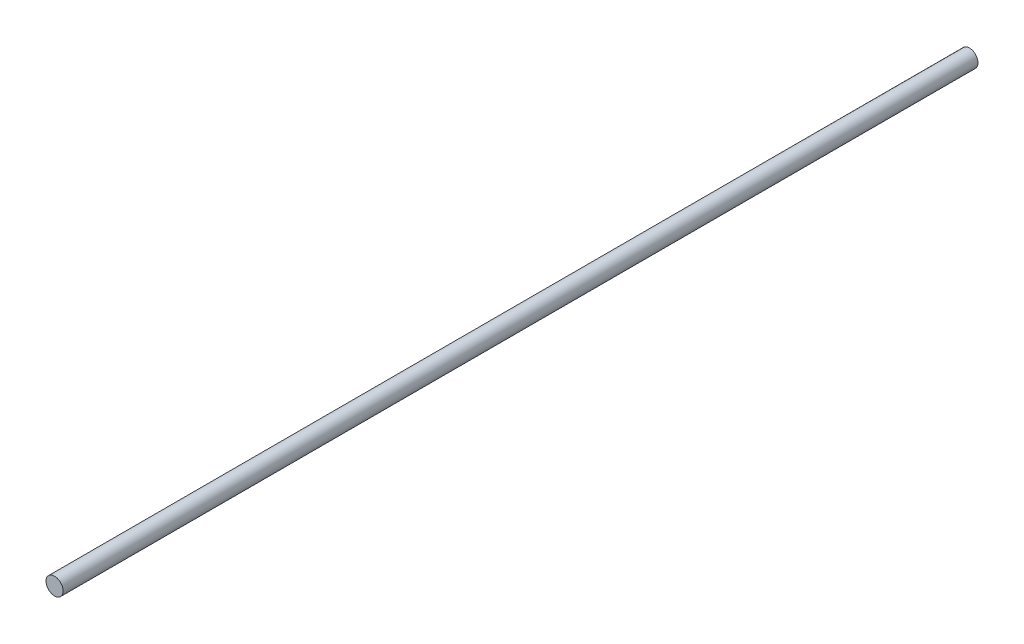
ISO-10303-21;
HEADER;
FILE_DESCRIPTION(('STEP AP214'),'2;1');
FILE_NAME('part.step','',(''),(''),'','','');
FILE_SCHEMA(('AUTOMOTIVE_DESIGN { 1 0 10303 214 1 1 1 1 }'));
ENDSEC;
DATA;
#1=APPLICATION_CONTEXT('core data for automotive mechanical design processes');
#2=APPLICATION_PROTOCOL_DEFINITION('international standard','automotive_design',2000,#1);
#3=PRODUCT_CONTEXT('',#1,'mechanical');
#4=PRODUCT('Part','Part','',(#3));
#5=PRODUCT_RELATED_PRODUCT_CATEGORY('part','',(#4));
#6=PRODUCT_DEFINITION_FORMATION('','',#4);
#7=PRODUCT_DEFINITION_CONTEXT('part definition',#1,'design');
#8=PRODUCT_DEFINITION('design','',#6,#7);
#9=PRODUCT_DEFINITION_SHAPE('','',#8);
#10=(LENGTH_UNIT() NAMED_UNIT(*) SI_UNIT(.MILLI.,.METRE.));
#11=(NAMED_UNIT(*) PLANE_ANGLE_UNIT() SI_UNIT($,.RADIAN.));
#12=(NAMED_UNIT(*) SI_UNIT($,.STERADIAN.) SOLID_ANGLE_UNIT());
#13=UNCERTAINTY_MEASURE_WITH_UNIT(LENGTH_MEASURE(1.E-05),#10,'distance_accuracy_value','');
#14=(GEOMETRIC_REPRESENTATION_CONTEXT(3) GLOBAL_UNCERTAINTY_ASSIGNED_CONTEXT((#13)) GLOBAL_UNIT_ASSIGNED_CONTEXT((#10,
#11,#12)) REPRESENTATION_CONTEXT('',''));
#15=CARTESIAN_POINT('',(0.,0.,0.));
#16=DIRECTION('',(0.,0.,1.));
#17=DIRECTION('',(1.,0.,0.));
#18=AXIS2_PLACEMENT_3D('',#15,#16,#17);
#19=CARTESIAN_POINT('',(0.,0.,160.));
#20=DIRECTION('',(0.,0.,-1.));
#21=DIRECTION('',(-1.,0.,0.));
#22=AXIS2_PLACEMENT_3D('',#19,#20,#21);
#23=CYLINDRICAL_SURFACE('',#22,1.5);
#24=CARTESIAN_POINT('',(0.,0.,160.));
#25=DIRECTION('',(0.,0.,1.));
#26=DIRECTION('',(1.,0.,0.));
#27=AXIS2_PLACEMENT_3D('',#24,#25,#26);
#28=CIRCLE('',#27,1.5);
#29=CARTESIAN_POINT('',(1.5,0.,160.));
#30=VERTEX_POINT('',#29);
#31=EDGE_CURVE('E10',#30,#30,#28,.T.);
#32=ORIENTED_EDGE('',*,*,#31,.F.);
#33=EDGE_LOOP('',(#32));
#34=FACE_BOUND('',#33,.T.);
#35=CARTESIAN_POINT('',(0.,0.,0.));
#36=DIRECTION('',(0.,0.,1.));
#37=DIRECTION('',(1.,0.,0.));
#38=AXIS2_PLACEMENT_3D('',#35,#36,#37);
#39=CIRCLE('',#38,1.5);
#40=CARTESIAN_POINT('',(1.5,0.,0.));
#41=VERTEX_POINT('',#40);
#42=EDGE_CURVE('E34',#41,#41,#39,.T.);
#43=ORIENTED_EDGE('',*,*,#42,.T.);
#44=EDGE_LOOP('',(#43));
#45=FACE_BOUND('',#44,.T.);
#46=ADVANCED_FACE('F31',(#34,#45),#23,.T.);
#47=CARTESIAN_POINT('',(0.,0.,160.));
#48=DIRECTION('',(0.,0.,1.));
#49=DIRECTION('',(1.,0.,0.));
#50=AXIS2_PLACEMENT_3D('',#47,#48,#49);
#51=PLANE('',#50);
#52=ORIENTED_EDGE('',*,*,#31,.T.);
#53=EDGE_LOOP('',(#52));
#54=FACE_BOUND('',#53,.T.);
#55=ADVANCED_FACE('F46',(#54),#51,.T.);
#56=CARTESIAN_POINT('',(0.,0.,0.));
#57=DIRECTION('',(0.,0.,1.));
#58=DIRECTION('',(1.,0.,0.));
#59=AXIS2_PLACEMENT_3D('',#56,#57,#58);
#60=PLANE('',#59);
#61=ORIENTED_EDGE('',*,*,#42,.F.);
#62=EDGE_LOOP('',(#61));
#63=FACE_BOUND('',#62,.T.);
#64=ADVANCED_FACE('F44',(#63),#60,.F.);
#65=CLOSED_SHELL('',(#46,#55,#64));
#66=MANIFOLD_SOLID_BREP('B2',#65);
#67=ADVANCED_BREP_SHAPE_REPRESENTATION('',(#18,#66),#14);
#68=SHAPE_DEFINITION_REPRESENTATION(#9,#67);
ENDSEC;
END-ISO-10303-21;
